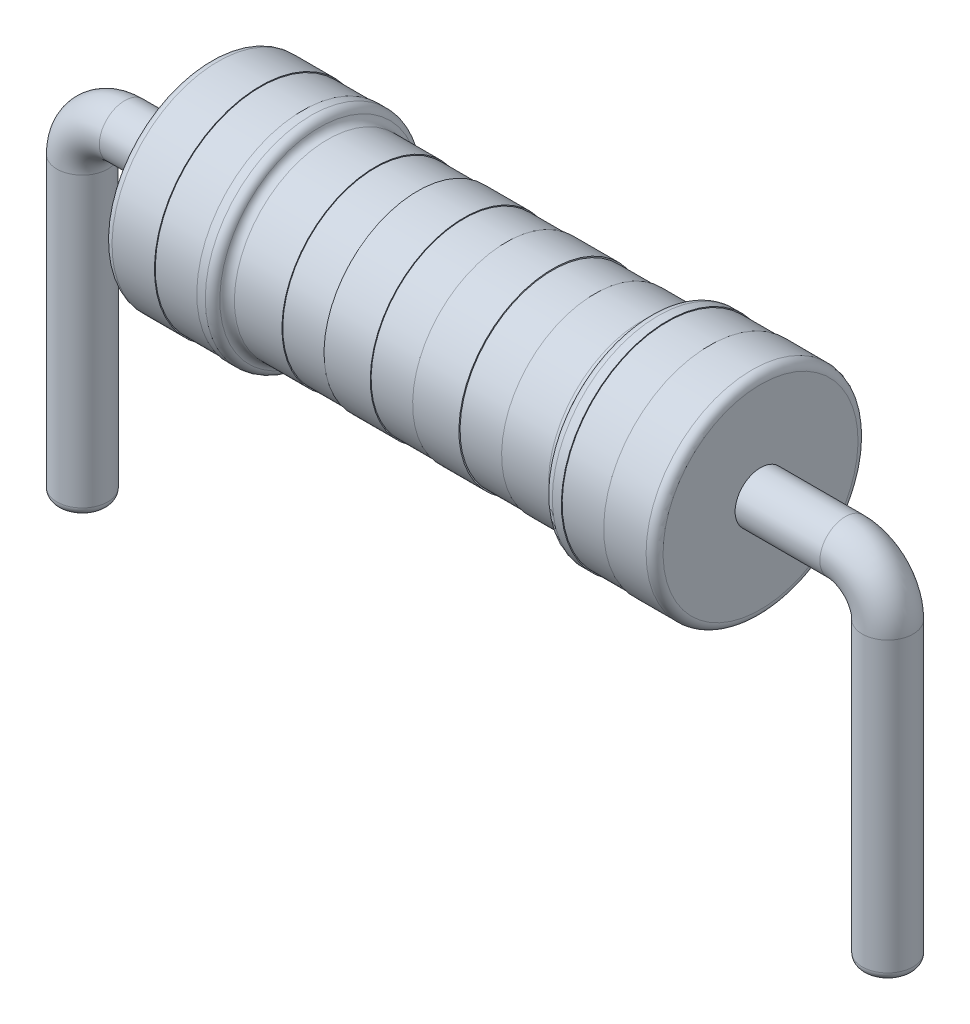
ISO-10303-21;
HEADER;
FILE_DESCRIPTION(('STEP AP214'),'2;1');
FILE_NAME('part.step','',(''),(''),'','','');
FILE_SCHEMA(('AUTOMOTIVE_DESIGN { 1 0 10303 214 1 1 1 1 }'));
ENDSEC;
DATA;
#1=APPLICATION_CONTEXT('core data for automotive mechanical design processes');
#2=APPLICATION_PROTOCOL_DEFINITION('international standard','automotive_design',2000,#1);
#3=PRODUCT_CONTEXT('',#1,'mechanical');
#4=PRODUCT('Part','Part','',(#3));
#5=PRODUCT_RELATED_PRODUCT_CATEGORY('part','',(#4));
#6=PRODUCT_DEFINITION_FORMATION('','',#4);
#7=PRODUCT_DEFINITION_CONTEXT('part definition',#1,'design');
#8=PRODUCT_DEFINITION('design','',#6,#7);
#9=PRODUCT_DEFINITION_SHAPE('','',#8);
#10=(LENGTH_UNIT() NAMED_UNIT(*) SI_UNIT(.MILLI.,.METRE.));
#11=(NAMED_UNIT(*) PLANE_ANGLE_UNIT() SI_UNIT($,.RADIAN.));
#12=(NAMED_UNIT(*) SI_UNIT($,.STERADIAN.) SOLID_ANGLE_UNIT());
#13=UNCERTAINTY_MEASURE_WITH_UNIT(LENGTH_MEASURE(1.E-05),#10,'distance_accuracy_value','');
#14=(GEOMETRIC_REPRESENTATION_CONTEXT(3) GLOBAL_UNCERTAINTY_ASSIGNED_CONTEXT((#13)) GLOBAL_UNIT_ASSIGNED_CONTEXT((#10,
#11,#12)) REPRESENTATION_CONTEXT('',''));
#15=CARTESIAN_POINT('',(0.,0.,0.));
#16=DIRECTION('',(0.,0.,1.));
#17=DIRECTION('',(1.,0.,0.));
#18=AXIS2_PLACEMENT_3D('',#15,#16,#17);
#19=CARTESIAN_POINT('',(3.25,0.,0.));
#20=DIRECTION('',(1.,0.,0.));
#21=DIRECTION('',(0.,1.,0.));
#22=AXIS2_PLACEMENT_3D('',#19,#20,#21);
#23=PLANE('',#22);
#24=CARTESIAN_POINT('',(3.25,0.,0.));
#25=DIRECTION('',(1.,0.,0.));
#26=DIRECTION('',(0.,1.,0.));
#27=AXIS2_PLACEMENT_3D('',#24,#25,#26);
#28=CIRCLE('',#27,0.3);
#29=CARTESIAN_POINT('',(3.25,0.300000000000001,0.));
#30=VERTEX_POINT('',#29);
#31=EDGE_CURVE('E56',#30,#30,#28,.T.);
#32=ORIENTED_EDGE('',*,*,#31,.F.);
#33=EDGE_LOOP('',(#32));
#34=FACE_BOUND('',#33,.T.);
#35=CARTESIAN_POINT('',(3.25,0.,0.));
#36=DIRECTION('',(1.,0.,0.));
#37=DIRECTION('',(0.,1.,0.));
#38=AXIS2_PLACEMENT_3D('',#35,#36,#37);
#39=CIRCLE('',#38,1.15);
#40=CARTESIAN_POINT('',(3.25,1.15,0.));
#41=VERTEX_POINT('',#40);
#42=EDGE_CURVE('E59',#41,#41,#39,.T.);
#43=ORIENTED_EDGE('',*,*,#42,.T.);
#44=EDGE_LOOP('',(#43));
#45=FACE_BOUND('',#44,.T.);
#46=ADVANCED_FACE('F33',(#34,#45),#23,.T.);
#47=CARTESIAN_POINT('',(-3.25,0.,0.));
#48=DIRECTION('',(-1.,0.,0.));
#49=DIRECTION('',(0.,-1.,0.));
#50=AXIS2_PLACEMENT_3D('',#47,#48,#49);
#51=CYLINDRICAL_SURFACE('',#50,1.25);
#52=CARTESIAN_POINT('',(3.15,0.,0.));
#53=DIRECTION('',(1.,0.,0.));
#54=DIRECTION('',(0.,1.,0.));
#55=AXIS2_PLACEMENT_3D('',#52,#53,#54);
#56=CIRCLE('',#55,1.25);
#57=CARTESIAN_POINT('',(3.15,1.25,0.));
#58=VERTEX_POINT('',#57);
#59=EDGE_CURVE('E62',#58,#58,#56,.F.);
#60=ORIENTED_EDGE('',*,*,#59,.T.);
#61=EDGE_LOOP('',(#60));
#62=FACE_BOUND('',#61,.T.);
#63=CARTESIAN_POINT('',(2.65,0.,0.));
#64=DIRECTION('',(-1.,0.,0.));
#65=DIRECTION('',(0.,-1.,0.));
#66=AXIS2_PLACEMENT_3D('',#63,#64,#65);
#67=CIRCLE('',#66,1.25);
#68=CARTESIAN_POINT('',(2.65,-1.25,0.));
#69=VERTEX_POINT('',#68);
#70=EDGE_CURVE('E89',#69,#69,#67,.T.);
#71=ORIENTED_EDGE('',*,*,#70,.F.);
#72=EDGE_LOOP('',(#71));
#73=FACE_BOUND('',#72,.T.);
#74=ADVANCED_FACE('F195',(#62,#73),#51,.T.);
#75=CARTESIAN_POINT('',(2.65,-1.25,0.));
#76=DIRECTION('',(-1.,0.,0.));
#77=DIRECTION('',(0.,-1.,0.));
#78=AXIS2_PLACEMENT_3D('',#75,#76,#77);
#79=PLANE('',#78);
#80=ORIENTED_EDGE('',*,*,#70,.T.);
#81=EDGE_LOOP('',(#80));
#82=FACE_BOUND('',#81,.T.);
#83=CARTESIAN_POINT('',(2.65,0.,0.));
#84=DIRECTION('',(-1.,0.,0.));
#85=DIRECTION('',(0.,-1.,0.));
#86=AXIS2_PLACEMENT_3D('',#83,#84,#85);
#87=CIRCLE('',#86,1.24);
#88=CARTESIAN_POINT('',(2.65,-1.24,0.));
#89=VERTEX_POINT('',#88);
#90=EDGE_CURVE('E92',#89,#89,#87,.T.);
#91=ORIENTED_EDGE('',*,*,#90,.F.);
#92=EDGE_LOOP('',(#91));
#93=FACE_BOUND('',#92,.T.);
#94=ADVANCED_FACE('F201',(#82,#93),#79,.T.);
#95=CARTESIAN_POINT('',(-3.25,0.,0.));
#96=DIRECTION('',(-1.,0.,0.));
#97=DIRECTION('',(0.,-1.,0.));
#98=AXIS2_PLACEMENT_3D('',#95,#96,#97);
#99=CYLINDRICAL_SURFACE('',#98,1.24);
#100=ORIENTED_EDGE('',*,*,#90,.T.);
#101=EDGE_LOOP('',(#100));
#102=FACE_BOUND('',#101,.T.);
#103=CARTESIAN_POINT('',(2.15,0.,0.));
#104=DIRECTION('',(-1.,0.,0.));
#105=DIRECTION('',(0.,-1.,0.));
#106=AXIS2_PLACEMENT_3D('',#103,#104,#105);
#107=CIRCLE('',#106,1.24);
#108=CARTESIAN_POINT('',(2.15,-1.24,0.));
#109=VERTEX_POINT('',#108);
#110=EDGE_CURVE('E95',#109,#109,#107,.T.);
#111=ORIENTED_EDGE('',*,*,#110,.F.);
#112=EDGE_LOOP('',(#111));
#113=FACE_BOUND('',#112,.T.);
#114=ADVANCED_FACE('F209',(#102,#113),#99,.T.);
#115=CARTESIAN_POINT('',(2.15,-1.24,0.));
#116=DIRECTION('',(1.,0.,0.));
#117=DIRECTION('',(0.,1.,0.));
#118=AXIS2_PLACEMENT_3D('',#115,#116,#117);
#119=PLANE('',#118);
#120=ORIENTED_EDGE('',*,*,#110,.T.);
#121=EDGE_LOOP('',(#120));
#122=FACE_BOUND('',#121,.T.);
#123=CARTESIAN_POINT('',(2.15,0.,0.));
#124=DIRECTION('',(-1.,0.,0.));
#125=DIRECTION('',(0.,-1.,0.));
#126=AXIS2_PLACEMENT_3D('',#123,#124,#125);
#127=CIRCLE('',#126,1.25);
#128=CARTESIAN_POINT('',(2.15,-1.25,0.));
#129=VERTEX_POINT('',#128);
#130=EDGE_CURVE('E98',#129,#129,#127,.T.);
#131=ORIENTED_EDGE('',*,*,#130,.F.);
#132=EDGE_LOOP('',(#131));
#133=FACE_BOUND('',#132,.T.);
#134=ADVANCED_FACE('F213',(#122,#133),#119,.T.);
#135=CARTESIAN_POINT('',(-3.25,0.,0.));
#136=DIRECTION('',(-1.,0.,0.));
#137=DIRECTION('',(0.,-1.,0.));
#138=AXIS2_PLACEMENT_3D('',#135,#136,#137);
#139=CYLINDRICAL_SURFACE('',#138,1.25);
#140=CARTESIAN_POINT('',(2.0436491673104,0.,0.));
#141=DIRECTION('',(1.,0.,0.));
#142=DIRECTION('',(0.,1.,0.));
#143=AXIS2_PLACEMENT_3D('',#140,#141,#142);
#144=CIRCLE('',#143,1.25);
#145=CARTESIAN_POINT('',(2.0436491673104,1.25,0.));
#146=VERTEX_POINT('',#145);
#147=EDGE_CURVE('E71',#146,#146,#144,.T.);
#148=ORIENTED_EDGE('',*,*,#147,.T.);
#149=EDGE_LOOP('',(#148));
#150=FACE_BOUND('',#149,.T.);
#151=ORIENTED_EDGE('',*,*,#130,.T.);
#152=EDGE_LOOP('',(#151));
#153=FACE_BOUND('',#152,.T.);
#154=ADVANCED_FACE('F217',(#150,#153),#139,.T.);
#155=CARTESIAN_POINT('',(-3.25,0.,0.));
#156=DIRECTION('',(-1.,0.,0.));
#157=DIRECTION('',(0.,-1.,0.));
#158=AXIS2_PLACEMENT_3D('',#155,#156,#157);
#159=CYLINDRICAL_SURFACE('',#158,1.1);
#160=CARTESIAN_POINT('',(1.85,0.,0.));
#161=DIRECTION('',(-1.,0.,0.));
#162=DIRECTION('',(0.,-1.,0.));
#163=AXIS2_PLACEMENT_3D('',#160,#161,#162);
#164=CIRCLE('',#163,1.1);
#165=CARTESIAN_POINT('',(1.85,-1.1,0.));
#166=VERTEX_POINT('',#165);
#167=EDGE_CURVE('E86',#166,#166,#164,.T.);
#168=ORIENTED_EDGE('',*,*,#167,.T.);
#169=EDGE_LOOP('',(#168));
#170=FACE_BOUND('',#169,.T.);
#171=CARTESIAN_POINT('',(1.29552343653446,0.,0.));
#172=DIRECTION('',(-1.,0.,0.));
#173=DIRECTION('',(0.,-1.,0.));
#174=AXIS2_PLACEMENT_3D('',#171,#172,#173);
#175=CIRCLE('',#174,1.1);
#176=CARTESIAN_POINT('',(1.29552343653446,-1.1,0.));
#177=VERTEX_POINT('',#176);
#178=EDGE_CURVE('E101',#177,#177,#175,.T.);
#179=ORIENTED_EDGE('',*,*,#178,.F.);
#180=EDGE_LOOP('',(#179));
#181=FACE_BOUND('',#180,.T.);
#182=ADVANCED_FACE('F221',(#170,#181),#159,.T.);
#183=CARTESIAN_POINT('',(1.29552343653446,-1.1,0.));
#184=DIRECTION('',(-1.,0.,0.));
#185=DIRECTION('',(0.,-1.,0.));
#186=AXIS2_PLACEMENT_3D('',#183,#184,#185);
#187=PLANE('',#186);
#188=ORIENTED_EDGE('',*,*,#178,.T.);
#189=EDGE_LOOP('',(#188));
#190=FACE_BOUND('',#189,.T.);
#191=CARTESIAN_POINT('',(1.29552343653446,0.,0.));
#192=DIRECTION('',(-1.,0.,0.));
#193=DIRECTION('',(0.,-1.,0.));
#194=AXIS2_PLACEMENT_3D('',#191,#192,#193);
#195=CIRCLE('',#194,1.09);
#196=CARTESIAN_POINT('',(1.29552343653446,-1.09,0.));
#197=VERTEX_POINT('',#196);
#198=EDGE_CURVE('E104',#197,#197,#195,.T.);
#199=ORIENTED_EDGE('',*,*,#198,.F.);
#200=EDGE_LOOP('',(#199));
#201=FACE_BOUND('',#200,.T.);
#202=ADVANCED_FACE('F225',(#190,#201),#187,.T.);
#203=CARTESIAN_POINT('',(-3.25,0.,0.));
#204=DIRECTION('',(-1.,0.,0.));
#205=DIRECTION('',(0.,-1.,0.));
#206=AXIS2_PLACEMENT_3D('',#203,#204,#205);
#207=CYLINDRICAL_SURFACE('',#206,1.09);
#208=ORIENTED_EDGE('',*,*,#198,.T.);
#209=EDGE_LOOP('',(#208));
#210=FACE_BOUND('',#209,.T.);
#211=CARTESIAN_POINT('',(0.795523436534458,0.,0.));
#212=DIRECTION('',(-1.,0.,0.));
#213=DIRECTION('',(0.,-1.,0.));
#214=AXIS2_PLACEMENT_3D('',#211,#212,#213);
#215=CIRCLE('',#214,1.09);
#216=CARTESIAN_POINT('',(0.795523436534458,-1.09,0.));
#217=VERTEX_POINT('',#216);
#218=EDGE_CURVE('E107',#217,#217,#215,.T.);
#219=ORIENTED_EDGE('',*,*,#218,.F.);
#220=EDGE_LOOP('',(#219));
#221=FACE_BOUND('',#220,.T.);
#222=ADVANCED_FACE('F229',(#210,#221),#207,.T.);
#223=CARTESIAN_POINT('',(0.795523436534458,-1.09,0.));
#224=DIRECTION('',(1.,0.,0.));
#225=DIRECTION('',(0.,1.,0.));
#226=AXIS2_PLACEMENT_3D('',#223,#224,#225);
#227=PLANE('',#226);
#228=ORIENTED_EDGE('',*,*,#218,.T.);
#229=EDGE_LOOP('',(#228));
#230=FACE_BOUND('',#229,.T.);
#231=CARTESIAN_POINT('',(0.795523436534458,0.,0.));
#232=DIRECTION('',(-1.,0.,0.));
#233=DIRECTION('',(0.,-1.,0.));
#234=AXIS2_PLACEMENT_3D('',#231,#232,#233);
#235=CIRCLE('',#234,1.10375370034682);
#236=CARTESIAN_POINT('',(0.795523436534458,-1.10375370034682,0.));
#237=VERTEX_POINT('',#236);
#238=EDGE_CURVE('E110',#237,#237,#235,.T.);
#239=ORIENTED_EDGE('',*,*,#238,.F.);
#240=EDGE_LOOP('',(#239));
#241=FACE_BOUND('',#240,.T.);
#242=ADVANCED_FACE('F233',(#230,#241),#227,.T.);
#243=CARTESIAN_POINT('',(-3.25,0.,0.));
#244=DIRECTION('',(-1.,0.,0.));
#245=DIRECTION('',(0.,-1.,0.));
#246=AXIS2_PLACEMENT_3D('',#243,#244,#245);
#247=CYLINDRICAL_SURFACE('',#246,1.10375370034682);
#248=ORIENTED_EDGE('',*,*,#238,.T.);
#249=EDGE_LOOP('',(#248));
#250=FACE_BOUND('',#249,.T.);
#251=CARTESIAN_POINT('',(0.25,0.,0.));
#252=DIRECTION('',(-1.,0.,0.));
#253=DIRECTION('',(0.,-1.,0.));
#254=AXIS2_PLACEMENT_3D('',#251,#252,#253);
#255=CIRCLE('',#254,1.10375370034682);
#256=CARTESIAN_POINT('',(0.25,-1.10375370034682,0.));
#257=VERTEX_POINT('',#256);
#258=EDGE_CURVE('E113',#257,#257,#255,.T.);
#259=ORIENTED_EDGE('',*,*,#258,.F.);
#260=EDGE_LOOP('',(#259));
#261=FACE_BOUND('',#260,.T.);
#262=ADVANCED_FACE('F237',(#250,#261),#247,.T.);
#263=CARTESIAN_POINT('',(0.25,-1.10375370034682,0.));
#264=DIRECTION('',(-1.,0.,0.));
#265=DIRECTION('',(0.,-1.,0.));
#266=AXIS2_PLACEMENT_3D('',#263,#264,#265);
#267=PLANE('',#266);
#268=ORIENTED_EDGE('',*,*,#258,.T.);
#269=EDGE_LOOP('',(#268));
#270=FACE_BOUND('',#269,.T.);
#271=CARTESIAN_POINT('',(0.25,0.,0.));
#272=DIRECTION('',(-1.,0.,0.));
#273=DIRECTION('',(0.,-1.,0.));
#274=AXIS2_PLACEMENT_3D('',#271,#272,#273);
#275=CIRCLE('',#274,1.09375370034682);
#276=CARTESIAN_POINT('',(0.25,-1.09375370034682,0.));
#277=VERTEX_POINT('',#276);
#278=EDGE_CURVE('E116',#277,#277,#275,.T.);
#279=ORIENTED_EDGE('',*,*,#278,.F.);
#280=EDGE_LOOP('',(#279));
#281=FACE_BOUND('',#280,.T.);
#282=ADVANCED_FACE('F241',(#270,#281),#267,.T.);
#283=CARTESIAN_POINT('',(-3.25,0.,0.));
#284=DIRECTION('',(-1.,0.,0.));
#285=DIRECTION('',(0.,-1.,0.));
#286=AXIS2_PLACEMENT_3D('',#283,#284,#285);
#287=CYLINDRICAL_SURFACE('',#286,1.09375370034682);
#288=ORIENTED_EDGE('',*,*,#278,.T.);
#289=EDGE_LOOP('',(#288));
#290=FACE_BOUND('',#289,.T.);
#291=CARTESIAN_POINT('',(-0.25,0.,0.));
#292=DIRECTION('',(-1.,0.,0.));
#293=DIRECTION('',(0.,-1.,0.));
#294=AXIS2_PLACEMENT_3D('',#291,#292,#293);
#295=CIRCLE('',#294,1.09375370034682);
#296=CARTESIAN_POINT('',(-0.25,-1.09375370034682,0.));
#297=VERTEX_POINT('',#296);
#298=EDGE_CURVE('E119',#297,#297,#295,.T.);
#299=ORIENTED_EDGE('',*,*,#298,.F.);
#300=EDGE_LOOP('',(#299));
#301=FACE_BOUND('',#300,.T.);
#302=ADVANCED_FACE('F245',(#290,#301),#287,.T.);
#303=CARTESIAN_POINT('',(-0.25,-1.10375370034682,0.));
#304=DIRECTION('',(1.,0.,0.));
#305=DIRECTION('',(0.,1.,0.));
#306=AXIS2_PLACEMENT_3D('',#303,#304,#305);
#307=PLANE('',#306);
#308=ORIENTED_EDGE('',*,*,#298,.T.);
#309=EDGE_LOOP('',(#308));
#310=FACE_BOUND('',#309,.T.);
#311=CARTESIAN_POINT('',(-0.25,0.,0.));
#312=DIRECTION('',(-1.,0.,0.));
#313=DIRECTION('',(0.,-1.,0.));
#314=AXIS2_PLACEMENT_3D('',#311,#312,#313);
#315=CIRCLE('',#314,1.10375370034682);
#316=CARTESIAN_POINT('',(-0.25,-1.10375370034682,0.));
#317=VERTEX_POINT('',#316);
#318=EDGE_CURVE('E122',#317,#317,#315,.T.);
#319=ORIENTED_EDGE('',*,*,#318,.F.);
#320=EDGE_LOOP('',(#319));
#321=FACE_BOUND('',#320,.T.);
#322=ADVANCED_FACE('F249',(#310,#321),#307,.T.);
#323=CARTESIAN_POINT('',(-3.25,0.,0.));
#324=DIRECTION('',(-1.,0.,0.));
#325=DIRECTION('',(0.,-1.,0.));
#326=AXIS2_PLACEMENT_3D('',#323,#324,#325);
#327=CYLINDRICAL_SURFACE('',#326,1.10375370034682);
#328=ORIENTED_EDGE('',*,*,#318,.T.);
#329=EDGE_LOOP('',(#328));
#330=FACE_BOUND('',#329,.T.);
#331=CARTESIAN_POINT('',(-0.795523436534458,0.,0.));
#332=DIRECTION('',(-1.,0.,0.));
#333=DIRECTION('',(0.,-1.,0.));
#334=AXIS2_PLACEMENT_3D('',#331,#332,#333);
#335=CIRCLE('',#334,1.10375370034682);
#336=CARTESIAN_POINT('',(-0.795523436534457,-1.10375370034682,0.));
#337=VERTEX_POINT('',#336);
#338=EDGE_CURVE('E125',#337,#337,#335,.T.);
#339=ORIENTED_EDGE('',*,*,#338,.F.);
#340=EDGE_LOOP('',(#339));
#341=FACE_BOUND('',#340,.T.);
#342=ADVANCED_FACE('F253',(#330,#341),#327,.T.);
#343=CARTESIAN_POINT('',(-0.795523436534457,-1.09,0.));
#344=DIRECTION('',(-1.,0.,0.));
#345=DIRECTION('',(0.,-1.,0.));
#346=AXIS2_PLACEMENT_3D('',#343,#344,#345);
#347=PLANE('',#346);
#348=ORIENTED_EDGE('',*,*,#338,.T.);
#349=EDGE_LOOP('',(#348));
#350=FACE_BOUND('',#349,.T.);
#351=CARTESIAN_POINT('',(-0.795523436534458,0.,0.));
#352=DIRECTION('',(-1.,0.,0.));
#353=DIRECTION('',(0.,-1.,0.));
#354=AXIS2_PLACEMENT_3D('',#351,#352,#353);
#355=CIRCLE('',#354,1.09);
#356=CARTESIAN_POINT('',(-0.795523436534457,-1.09,0.));
#357=VERTEX_POINT('',#356);
#358=EDGE_CURVE('E128',#357,#357,#355,.T.);
#359=ORIENTED_EDGE('',*,*,#358,.F.);
#360=EDGE_LOOP('',(#359));
#361=FACE_BOUND('',#360,.T.);
#362=ADVANCED_FACE('F257',(#350,#361),#347,.T.);
#363=CARTESIAN_POINT('',(-3.25,0.,0.));
#364=DIRECTION('',(-1.,0.,0.));
#365=DIRECTION('',(0.,-1.,0.));
#366=AXIS2_PLACEMENT_3D('',#363,#364,#365);
#367=CYLINDRICAL_SURFACE('',#366,1.09);
#368=ORIENTED_EDGE('',*,*,#358,.T.);
#369=EDGE_LOOP('',(#368));
#370=FACE_BOUND('',#369,.T.);
#371=CARTESIAN_POINT('',(-1.29552343653446,0.,0.));
#372=DIRECTION('',(-1.,0.,0.));
#373=DIRECTION('',(0.,-1.,0.));
#374=AXIS2_PLACEMENT_3D('',#371,#372,#373);
#375=CIRCLE('',#374,1.09);
#376=CARTESIAN_POINT('',(-1.29552343653446,-1.09,0.));
#377=VERTEX_POINT('',#376);
#378=EDGE_CURVE('E131',#377,#377,#375,.T.);
#379=ORIENTED_EDGE('',*,*,#378,.F.);
#380=EDGE_LOOP('',(#379));
#381=FACE_BOUND('',#380,.T.);
#382=ADVANCED_FACE('F261',(#370,#381),#367,.T.);
#383=CARTESIAN_POINT('',(-1.29552343653446,-1.1,0.));
#384=DIRECTION('',(1.,0.,0.));
#385=DIRECTION('',(0.,1.,0.));
#386=AXIS2_PLACEMENT_3D('',#383,#384,#385);
#387=PLANE('',#386);
#388=ORIENTED_EDGE('',*,*,#378,.T.);
#389=EDGE_LOOP('',(#388));
#390=FACE_BOUND('',#389,.T.);
#391=CARTESIAN_POINT('',(-1.29552343653446,0.,0.));
#392=DIRECTION('',(-1.,0.,0.));
#393=DIRECTION('',(0.,-1.,0.));
#394=AXIS2_PLACEMENT_3D('',#391,#392,#393);
#395=CIRCLE('',#394,1.1);
#396=CARTESIAN_POINT('',(-1.29552343653446,-1.1,0.));
#397=VERTEX_POINT('',#396);
#398=EDGE_CURVE('E134',#397,#397,#395,.T.);
#399=ORIENTED_EDGE('',*,*,#398,.F.);
#400=EDGE_LOOP('',(#399));
#401=FACE_BOUND('',#400,.T.);
#402=ADVANCED_FACE('F265',(#390,#401),#387,.T.);
#403=CARTESIAN_POINT('',(-3.25,0.,0.));
#404=DIRECTION('',(-1.,0.,0.));
#405=DIRECTION('',(0.,-1.,0.));
#406=AXIS2_PLACEMENT_3D('',#403,#404,#405);
#407=CYLINDRICAL_SURFACE('',#406,1.1);
#408=CARTESIAN_POINT('',(-1.85635083268958,0.,0.));
#409=DIRECTION('',(-1.,0.,0.));
#410=DIRECTION('',(0.,-1.,0.));
#411=AXIS2_PLACEMENT_3D('',#408,#409,#410);
#412=CIRCLE('',#411,1.1);
#413=CARTESIAN_POINT('',(-1.85635083268958,-1.1,0.));
#414=VERTEX_POINT('',#413);
#415=EDGE_CURVE('E65',#414,#414,#412,.F.);
#416=ORIENTED_EDGE('',*,*,#415,.T.);
#417=EDGE_LOOP('',(#416));
#418=FACE_BOUND('',#417,.T.);
#419=ORIENTED_EDGE('',*,*,#398,.T.);
#420=EDGE_LOOP('',(#419));
#421=FACE_BOUND('',#420,.T.);
#422=ADVANCED_FACE('F269',(#418,#421),#407,.T.);
#423=CARTESIAN_POINT('',(-3.25,0.,0.));
#424=DIRECTION('',(-1.,0.,0.));
#425=DIRECTION('',(0.,-1.,0.));
#426=AXIS2_PLACEMENT_3D('',#423,#424,#425);
#427=CYLINDRICAL_SURFACE('',#426,1.25);
#428=CARTESIAN_POINT('',(-2.05,0.,0.));
#429=DIRECTION('',(1.,0.,0.));
#430=DIRECTION('',(0.,1.,0.));
#431=AXIS2_PLACEMENT_3D('',#428,#429,#430);
#432=CIRCLE('',#431,1.25);
#433=CARTESIAN_POINT('',(-2.05,1.25,0.));
#434=VERTEX_POINT('',#433);
#435=EDGE_CURVE('E77',#434,#434,#432,.F.);
#436=ORIENTED_EDGE('',*,*,#435,.T.);
#437=EDGE_LOOP('',(#436));
#438=FACE_BOUND('',#437,.T.);
#439=CARTESIAN_POINT('',(-2.15,0.,0.));
#440=DIRECTION('',(-1.,0.,0.));
#441=DIRECTION('',(0.,-1.,0.));
#442=AXIS2_PLACEMENT_3D('',#439,#440,#441);
#443=CIRCLE('',#442,1.25);
#444=CARTESIAN_POINT('',(-2.15,-1.25,0.));
#445=VERTEX_POINT('',#444);
#446=EDGE_CURVE('E137',#445,#445,#443,.T.);
#447=ORIENTED_EDGE('',*,*,#446,.F.);
#448=EDGE_LOOP('',(#447));
#449=FACE_BOUND('',#448,.T.);
#450=ADVANCED_FACE('F273',(#438,#449),#427,.T.);
#451=CARTESIAN_POINT('',(-2.15,-1.24,0.));
#452=DIRECTION('',(-1.,0.,0.));
#453=DIRECTION('',(0.,-1.,0.));
#454=AXIS2_PLACEMENT_3D('',#451,#452,#453);
#455=PLANE('',#454);
#456=ORIENTED_EDGE('',*,*,#446,.T.);
#457=EDGE_LOOP('',(#456));
#458=FACE_BOUND('',#457,.T.);
#459=CARTESIAN_POINT('',(-2.15,0.,0.));
#460=DIRECTION('',(-1.,0.,0.));
#461=DIRECTION('',(0.,-1.,0.));
#462=AXIS2_PLACEMENT_3D('',#459,#460,#461);
#463=CIRCLE('',#462,1.24);
#464=CARTESIAN_POINT('',(-2.15,-1.24,0.));
#465=VERTEX_POINT('',#464);
#466=EDGE_CURVE('E140',#465,#465,#463,.T.);
#467=ORIENTED_EDGE('',*,*,#466,.F.);
#468=EDGE_LOOP('',(#467));
#469=FACE_BOUND('',#468,.T.);
#470=ADVANCED_FACE('F277',(#458,#469),#455,.T.);
#471=CARTESIAN_POINT('',(-3.25,0.,0.));
#472=DIRECTION('',(-1.,0.,0.));
#473=DIRECTION('',(0.,-1.,0.));
#474=AXIS2_PLACEMENT_3D('',#471,#472,#473);
#475=CYLINDRICAL_SURFACE('',#474,1.24);
#476=ORIENTED_EDGE('',*,*,#466,.T.);
#477=EDGE_LOOP('',(#476));
#478=FACE_BOUND('',#477,.T.);
#479=CARTESIAN_POINT('',(-2.65,0.,0.));
#480=DIRECTION('',(-1.,0.,0.));
#481=DIRECTION('',(0.,-1.,0.));
#482=AXIS2_PLACEMENT_3D('',#479,#480,#481);
#483=CIRCLE('',#482,1.24);
#484=CARTESIAN_POINT('',(-2.65,-1.24,0.));
#485=VERTEX_POINT('',#484);
#486=EDGE_CURVE('E143',#485,#485,#483,.T.);
#487=ORIENTED_EDGE('',*,*,#486,.F.);
#488=EDGE_LOOP('',(#487));
#489=FACE_BOUND('',#488,.T.);
#490=ADVANCED_FACE('F281',(#478,#489),#475,.T.);
#491=CARTESIAN_POINT('',(-2.65,-1.25,0.));
#492=DIRECTION('',(1.,0.,0.));
#493=DIRECTION('',(0.,1.,0.));
#494=AXIS2_PLACEMENT_3D('',#491,#492,#493);
#495=PLANE('',#494);
#496=ORIENTED_EDGE('',*,*,#486,.T.);
#497=EDGE_LOOP('',(#496));
#498=FACE_BOUND('',#497,.T.);
#499=CARTESIAN_POINT('',(-2.65,0.,0.));
#500=DIRECTION('',(-1.,0.,0.));
#501=DIRECTION('',(0.,-1.,0.));
#502=AXIS2_PLACEMENT_3D('',#499,#500,#501);
#503=CIRCLE('',#502,1.25);
#504=CARTESIAN_POINT('',(-2.65,-1.25,0.));
#505=VERTEX_POINT('',#504);
#506=EDGE_CURVE('E146',#505,#505,#503,.T.);
#507=ORIENTED_EDGE('',*,*,#506,.F.);
#508=EDGE_LOOP('',(#507));
#509=FACE_BOUND('',#508,.T.);
#510=ADVANCED_FACE('F285',(#498,#509),#495,.T.);
#511=CARTESIAN_POINT('',(-3.25,0.,0.));
#512=DIRECTION('',(-1.,0.,0.));
#513=DIRECTION('',(0.,-1.,0.));
#514=AXIS2_PLACEMENT_3D('',#511,#512,#513);
#515=CYLINDRICAL_SURFACE('',#514,1.25);
#516=CARTESIAN_POINT('',(-3.15,0.,0.));
#517=DIRECTION('',(-1.,0.,0.));
#518=DIRECTION('',(0.,-1.,0.));
#519=AXIS2_PLACEMENT_3D('',#516,#517,#518);
#520=CIRCLE('',#519,1.25);
#521=CARTESIAN_POINT('',(-3.15,-1.25,0.));
#522=VERTEX_POINT('',#521);
#523=EDGE_CURVE('E80',#522,#522,#520,.F.);
#524=ORIENTED_EDGE('',*,*,#523,.T.);
#525=EDGE_LOOP('',(#524));
#526=FACE_BOUND('',#525,.T.);
#527=ORIENTED_EDGE('',*,*,#506,.T.);
#528=EDGE_LOOP('',(#527));
#529=FACE_BOUND('',#528,.T.);
#530=ADVANCED_FACE('F175',(#526,#529),#515,.T.);
#531=CARTESIAN_POINT('',(-3.25,0.,0.));
#532=DIRECTION('',(-1.,0.,0.));
#533=DIRECTION('',(0.,-1.,0.));
#534=AXIS2_PLACEMENT_3D('',#531,#532,#533);
#535=PLANE('',#534);
#536=CARTESIAN_POINT('',(-3.25,0.,0.));
#537=DIRECTION('',(-1.,0.,0.));
#538=DIRECTION('',(0.,-1.,0.));
#539=AXIS2_PLACEMENT_3D('',#536,#537,#538);
#540=CIRCLE('',#539,0.3);
#541=CARTESIAN_POINT('',(-3.25,-0.299999999999999,0.));
#542=VERTEX_POINT('',#541);
#543=EDGE_CURVE('E53',#542,#542,#540,.T.);
#544=ORIENTED_EDGE('',*,*,#543,.F.);
#545=EDGE_LOOP('',(#544));
#546=FACE_BOUND('',#545,.T.);
#547=CARTESIAN_POINT('',(-3.25,0.,0.));
#548=DIRECTION('',(-1.,0.,0.));
#549=DIRECTION('',(0.,-1.,0.));
#550=AXIS2_PLACEMENT_3D('',#547,#548,#549);
#551=CIRCLE('',#550,1.15);
#552=CARTESIAN_POINT('',(-3.25,-1.15,0.));
#553=VERTEX_POINT('',#552);
#554=EDGE_CURVE('E83',#553,#553,#551,.T.);
#555=ORIENTED_EDGE('',*,*,#554,.T.);
#556=EDGE_LOOP('',(#555));
#557=FACE_BOUND('',#556,.T.);
#558=ADVANCED_FACE('F171',(#546,#557),#535,.T.);
#559=CARTESIAN_POINT('',(1.85,0.,0.));
#560=DIRECTION('',(-1.,0.,0.));
#561=DIRECTION('',(0.,-1.,0.));
#562=AXIS2_PLACEMENT_3D('',#559,#560,#561);
#563=TOROIDAL_SURFACE('',#562,1.2,0.1);
#564=CARTESIAN_POINT('',(1.94682458365521,0.,0.));
#565=DIRECTION('',(-1.,0.,0.));
#566=DIRECTION('',(0.,-1.,0.));
#567=AXIS2_PLACEMENT_3D('',#564,#565,#566);
#568=CIRCLE('',#567,1.175);
#569=CARTESIAN_POINT('',(1.94682458365521,-1.175,0.));
#570=VERTEX_POINT('',#569);
#571=EDGE_CURVE('E74',#570,#570,#568,.T.);
#572=ORIENTED_EDGE('',*,*,#571,.T.);
#573=EDGE_LOOP('',(#572));
#574=FACE_BOUND('',#573,.T.);
#575=ORIENTED_EDGE('',*,*,#167,.F.);
#576=EDGE_LOOP('',(#575));
#577=FACE_BOUND('',#576,.T.);
#578=ADVANCED_FACE('F174',(#574,#577),#563,.F.);
#579=CARTESIAN_POINT('',(-3.15,0.,0.));
#580=DIRECTION('',(-1.,0.,0.));
#581=DIRECTION('',(0.,-1.,0.));
#582=AXIS2_PLACEMENT_3D('',#579,#580,#581);
#583=TOROIDAL_SURFACE('',#582,1.15,0.1);
#584=ORIENTED_EDGE('',*,*,#523,.F.);
#585=EDGE_LOOP('',(#584));
#586=FACE_BOUND('',#585,.T.);
#587=ORIENTED_EDGE('',*,*,#554,.F.);
#588=EDGE_LOOP('',(#587));
#589=FACE_BOUND('',#588,.T.);
#590=ADVANCED_FACE('F179',(#586,#589),#583,.T.);
#591=CARTESIAN_POINT('',(-2.05,0.,0.));
#592=DIRECTION('',(1.,0.,0.));
#593=DIRECTION('',(0.,1.,0.));
#594=AXIS2_PLACEMENT_3D('',#591,#592,#593);
#595=TOROIDAL_SURFACE('',#594,1.15,0.1);
#596=CARTESIAN_POINT('',(-1.95317541634478,0.,0.));
#597=DIRECTION('',(-1.,0.,0.));
#598=DIRECTION('',(0.,-1.,0.));
#599=AXIS2_PLACEMENT_3D('',#596,#597,#598);
#600=CIRCLE('',#599,1.175);
#601=CARTESIAN_POINT('',(-1.95317541634478,-1.175,0.));
#602=VERTEX_POINT('',#601);
#603=EDGE_CURVE('E68',#602,#602,#600,.T.);
#604=ORIENTED_EDGE('',*,*,#603,.T.);
#605=EDGE_LOOP('',(#604));
#606=FACE_BOUND('',#605,.T.);
#607=ORIENTED_EDGE('',*,*,#435,.F.);
#608=EDGE_LOOP('',(#607));
#609=FACE_BOUND('',#608,.T.);
#610=ADVANCED_FACE('F181',(#606,#609),#595,.T.);
#611=CARTESIAN_POINT('',(2.0436491673104,0.,0.));
#612=DIRECTION('',(1.,0.,0.));
#613=DIRECTION('',(0.,1.,0.));
#614=AXIS2_PLACEMENT_3D('',#611,#612,#613);
#615=TOROIDAL_SURFACE('',#614,1.15000000000001,0.1);
#616=ORIENTED_EDGE('',*,*,#147,.F.);
#617=EDGE_LOOP('',(#616));
#618=FACE_BOUND('',#617,.T.);
#619=ORIENTED_EDGE('',*,*,#571,.F.);
#620=EDGE_LOOP('',(#619));
#621=FACE_BOUND('',#620,.T.);
#622=ADVANCED_FACE('F188',(#618,#621),#615,.T.);
#623=CARTESIAN_POINT('',(-1.85635083268958,0.,0.));
#624=DIRECTION('',(-1.,0.,0.));
#625=DIRECTION('',(0.,-1.,0.));
#626=AXIS2_PLACEMENT_3D('',#623,#624,#625);
#627=TOROIDAL_SURFACE('',#626,1.19999999999999,0.1);
#628=ORIENTED_EDGE('',*,*,#415,.F.);
#629=EDGE_LOOP('',(#628));
#630=FACE_BOUND('',#629,.T.);
#631=ORIENTED_EDGE('',*,*,#603,.F.);
#632=EDGE_LOOP('',(#631));
#633=FACE_BOUND('',#632,.T.);
#634=ADVANCED_FACE('F377',(#630,#633),#627,.F.);
#635=CARTESIAN_POINT('',(3.15,0.,0.));
#636=DIRECTION('',(1.,0.,0.));
#637=DIRECTION('',(0.,1.,0.));
#638=AXIS2_PLACEMENT_3D('',#635,#636,#637);
#639=TOROIDAL_SURFACE('',#638,1.15,0.1);
#640=ORIENTED_EDGE('',*,*,#42,.F.);
#641=EDGE_LOOP('',(#640));
#642=FACE_BOUND('',#641,.T.);
#643=ORIENTED_EDGE('',*,*,#59,.F.);
#644=EDGE_LOOP('',(#643));
#645=FACE_BOUND('',#644,.T.);
#646=ADVANCED_FACE('F297',(#642,#645),#639,.T.);
#647=CARTESIAN_POINT('',(4.75,-4.,0.));
#648=DIRECTION('',(0.,-1.,0.));
#649=DIRECTION('',(1.,0.,0.));
#650=AXIS2_PLACEMENT_3D('',#647,#648,#649);
#651=PLANE('',#650);
#652=CARTESIAN_POINT('',(4.75,-4.,0.));
#653=DIRECTION('',(0.,-1.,0.));
#654=DIRECTION('',(1.,0.,0.));
#655=AXIS2_PLACEMENT_3D('',#652,#653,#654);
#656=CIRCLE('',#655,0.2);
#657=CARTESIAN_POINT('',(4.95,-4.,0.));
#658=VERTEX_POINT('',#657);
#659=EDGE_CURVE('E48',#658,#658,#656,.T.);
#660=ORIENTED_EDGE('',*,*,#659,.T.);
#661=EDGE_LOOP('',(#660));
#662=FACE_BOUND('',#661,.T.);
#663=ADVANCED_FACE('F293',(#662),#651,.T.);
#664=CARTESIAN_POINT('',(3.25,0.,0.));
#665=DIRECTION('',(1.,0.,0.));
#666=DIRECTION('',(0.,1.,0.));
#667=AXIS2_PLACEMENT_3D('',#664,#665,#666);
#668=CYLINDRICAL_SURFACE('',#667,0.3);
#669=CARTESIAN_POINT('',(4.25,0.,0.));
#670=DIRECTION('',(1.,0.,0.));
#671=DIRECTION('',(0.,1.,0.));
#672=AXIS2_PLACEMENT_3D('',#669,#670,#671);
#673=CIRCLE('',#672,0.3);
#674=CARTESIAN_POINT('',(4.25,0.299999999999993,0.));
#675=VERTEX_POINT('',#674);
#676=EDGE_CURVE('E152',#675,#675,#673,.T.);
#677=ORIENTED_EDGE('',*,*,#676,.F.);
#678=EDGE_LOOP('',(#677));
#679=FACE_BOUND('',#678,.T.);
#680=ORIENTED_EDGE('',*,*,#31,.T.);
#681=EDGE_LOOP('',(#680));
#682=FACE_BOUND('',#681,.T.);
#683=ADVANCED_FACE('F296',(#679,#682),#668,.T.);
#684=CARTESIAN_POINT('',(4.25,-0.5,0.));
#685=DIRECTION('',(0.,0.,-1.));
#686=DIRECTION('',(-1.,0.,0.));
#687=AXIS2_PLACEMENT_3D('',#684,#685,#686);
#688=TOROIDAL_SURFACE('',#687,0.499999999999993,0.3);
#689=CARTESIAN_POINT('',(4.75,-0.5,0.));
#690=DIRECTION('',(0.,-1.,0.));
#691=DIRECTION('',(1.,0.,0.));
#692=AXIS2_PLACEMENT_3D('',#689,#690,#691);
#693=CIRCLE('',#692,0.3);
#694=CARTESIAN_POINT('',(5.04999999999999,-0.5,0.));
#695=VERTEX_POINT('',#694);
#696=EDGE_CURVE('E149',#695,#695,#693,.T.);
#697=CARTESIAN_POINT('',(4.25,-0.5,0.));
#698=DIRECTION('',(0.,0.,-1.));
#699=DIRECTION('',(-1.,0.,0.));
#700=AXIS2_PLACEMENT_3D('',#697,#698,#699);
#701=CIRCLE('',#700,0.799999999999993);
#702=EDGE_CURVE('',#675,#695,#701,.T.);
#703=ORIENTED_EDGE('',*,*,#676,.T.);
#704=ORIENTED_EDGE('',*,*,#696,.F.);
#705=ORIENTED_EDGE('',*,*,#702,.T.);
#706=ORIENTED_EDGE('',*,*,#702,.F.);
#707=EDGE_LOOP('',(#703,#705,#704,#706));
#708=FACE_BOUND('',#707,.T.);
#709=ADVANCED_FACE('F303',(#708),#688,.T.);
#710=CARTESIAN_POINT('',(4.75,-0.5,0.));
#711=DIRECTION('',(0.,-1.,0.));
#712=DIRECTION('',(0.,0.,-1.));
#713=AXIS2_PLACEMENT_3D('',#710,#711,#712);
#714=CYLINDRICAL_SURFACE('',#713,0.3);
#715=CARTESIAN_POINT('',(4.75,-3.9,0.));
#716=DIRECTION('',(0.,-1.,0.));
#717=DIRECTION('',(1.,0.,0.));
#718=AXIS2_PLACEMENT_3D('',#715,#716,#717);
#719=CIRCLE('',#718,0.3);
#720=CARTESIAN_POINT('',(5.05,-3.9,0.));
#721=VERTEX_POINT('',#720);
#722=EDGE_CURVE('E44',#721,#721,#719,.F.);
#723=ORIENTED_EDGE('',*,*,#722,.T.);
#724=EDGE_LOOP('',(#723));
#725=FACE_BOUND('',#724,.T.);
#726=ORIENTED_EDGE('',*,*,#696,.T.);
#727=EDGE_LOOP('',(#726));
#728=FACE_BOUND('',#727,.T.);
#729=ADVANCED_FACE('F300',(#725,#728),#714,.T.);
#730=CARTESIAN_POINT('',(-4.75,-4.,0.));
#731=DIRECTION('',(0.,-1.,0.));
#732=DIRECTION('',(-1.,0.,0.));
#733=AXIS2_PLACEMENT_3D('',#730,#731,#732);
#734=PLANE('',#733);
#735=CARTESIAN_POINT('',(-4.75,-4.,0.));
#736=DIRECTION('',(0.,-1.,0.));
#737=DIRECTION('',(1.,0.,0.));
#738=AXIS2_PLACEMENT_3D('',#735,#736,#737);
#739=CIRCLE('',#738,0.2);
#740=CARTESIAN_POINT('',(-4.55,-4.,0.));
#741=VERTEX_POINT('',#740);
#742=EDGE_CURVE('E40',#741,#741,#739,.T.);
#743=ORIENTED_EDGE('',*,*,#742,.T.);
#744=EDGE_LOOP('',(#743));
#745=FACE_BOUND('',#744,.T.);
#746=ADVANCED_FACE('F167',(#745),#734,.T.);
#747=CARTESIAN_POINT('',(-3.25,0.,0.));
#748=DIRECTION('',(-1.,0.,0.));
#749=DIRECTION('',(0.,-1.,0.));
#750=AXIS2_PLACEMENT_3D('',#747,#748,#749);
#751=CYLINDRICAL_SURFACE('',#750,0.3);
#752=CARTESIAN_POINT('',(-4.25,0.,0.));
#753=DIRECTION('',(1.,0.,0.));
#754=DIRECTION('',(0.,1.,0.));
#755=AXIS2_PLACEMENT_3D('',#752,#753,#754);
#756=CIRCLE('',#755,0.3);
#757=CARTESIAN_POINT('',(-4.25,0.299999999999993,0.));
#758=VERTEX_POINT('',#757);
#759=EDGE_CURVE('E158',#758,#758,#756,.F.);
#760=ORIENTED_EDGE('',*,*,#759,.F.);
#761=EDGE_LOOP('',(#760));
#762=FACE_BOUND('',#761,.T.);
#763=ORIENTED_EDGE('',*,*,#543,.T.);
#764=EDGE_LOOP('',(#763));
#765=FACE_BOUND('',#764,.T.);
#766=ADVANCED_FACE('F164',(#762,#765),#751,.T.);
#767=CARTESIAN_POINT('',(-4.25,-0.5,0.));
#768=DIRECTION('',(0.,0.,1.));
#769=DIRECTION('',(1.,0.,0.));
#770=AXIS2_PLACEMENT_3D('',#767,#768,#769);
#771=TOROIDAL_SURFACE('',#770,0.499999999999993,0.3);
#772=CARTESIAN_POINT('',(-4.75,-0.5,0.));
#773=DIRECTION('',(0.,1.,0.));
#774=DIRECTION('',(-1.,0.,0.));
#775=AXIS2_PLACEMENT_3D('',#772,#773,#774);
#776=CIRCLE('',#775,0.3);
#777=CARTESIAN_POINT('',(-5.04999999999999,-0.5,0.));
#778=VERTEX_POINT('',#777);
#779=EDGE_CURVE('E155',#778,#778,#776,.F.);
#780=CARTESIAN_POINT('',(-4.25,-0.5,0.));
#781=DIRECTION('',(0.,0.,1.));
#782=DIRECTION('',(1.,0.,0.));
#783=AXIS2_PLACEMENT_3D('',#780,#781,#782);
#784=CIRCLE('',#783,0.799999999999993);
#785=EDGE_CURVE('',#758,#778,#784,.T.);
#786=ORIENTED_EDGE('',*,*,#759,.T.);
#787=ORIENTED_EDGE('',*,*,#779,.F.);
#788=ORIENTED_EDGE('',*,*,#785,.T.);
#789=ORIENTED_EDGE('',*,*,#785,.F.);
#790=EDGE_LOOP('',(#786,#788,#787,#789));
#791=FACE_BOUND('',#790,.T.);
#792=ADVANCED_FACE('F162',(#791),#771,.T.);
#793=CARTESIAN_POINT('',(-4.75,-0.5,0.));
#794=DIRECTION('',(0.,-1.,0.));
#795=DIRECTION('',(0.,0.,-1.));
#796=AXIS2_PLACEMENT_3D('',#793,#794,#795);
#797=CYLINDRICAL_SURFACE('',#796,0.3);
#798=CARTESIAN_POINT('',(-4.75,-3.9,0.));
#799=DIRECTION('',(0.,-1.,0.));
#800=DIRECTION('',(1.,0.,0.));
#801=AXIS2_PLACEMENT_3D('',#798,#799,#800);
#802=CIRCLE('',#801,0.3);
#803=CARTESIAN_POINT('',(-4.45,-3.9,0.));
#804=VERTEX_POINT('',#803);
#805=EDGE_CURVE('E10',#804,#804,#802,.F.);
#806=ORIENTED_EDGE('',*,*,#805,.T.);
#807=EDGE_LOOP('',(#806));
#808=FACE_BOUND('',#807,.T.);
#809=ORIENTED_EDGE('',*,*,#779,.T.);
#810=EDGE_LOOP('',(#809));
#811=FACE_BOUND('',#810,.T.);
#812=ADVANCED_FACE('F299',(#808,#811),#797,.T.);
#813=CARTESIAN_POINT('',(4.75,-3.9,0.));
#814=DIRECTION('',(0.,-1.,0.));
#815=DIRECTION('',(1.,0.,0.));
#816=AXIS2_PLACEMENT_3D('',#813,#814,#815);
#817=TOROIDAL_SURFACE('',#816,0.2,0.1);
#818=ORIENTED_EDGE('',*,*,#722,.F.);
#819=EDGE_LOOP('',(#818));
#820=FACE_BOUND('',#819,.T.);
#821=ORIENTED_EDGE('',*,*,#659,.F.);
#822=EDGE_LOOP('',(#821));
#823=FACE_BOUND('',#822,.T.);
#824=ADVANCED_FACE('F313',(#820,#823),#817,.T.);
#825=CARTESIAN_POINT('',(-4.75,-3.9,0.));
#826=DIRECTION('',(0.,-1.,0.));
#827=DIRECTION('',(1.,0.,0.));
#828=AXIS2_PLACEMENT_3D('',#825,#826,#827);
#829=TOROIDAL_SURFACE('',#828,0.2,0.1);
#830=ORIENTED_EDGE('',*,*,#805,.F.);
#831=EDGE_LOOP('',(#830));
#832=FACE_BOUND('',#831,.T.);
#833=ORIENTED_EDGE('',*,*,#742,.F.);
#834=EDGE_LOOP('',(#833));
#835=FACE_BOUND('',#834,.T.);
#836=ADVANCED_FACE('F35',(#832,#835),#829,.T.);
#837=CLOSED_SHELL('',(#46,#74,#94,#114,#134,#154,#182,#202,#222,#242,#262,#282,#302,#322,#342,
#362,#382,#402,#422,#450,#470,#490,#510,#530,#558,#578,#590,#610,#622,#634,#646,#663,#683,#709,
#729,#746,#766,#792,#812,#824,#836));
#838=MANIFOLD_SOLID_BREP('B2',#837);
#839=ADVANCED_BREP_SHAPE_REPRESENTATION('',(#18,#838),#14);
#840=SHAPE_DEFINITION_REPRESENTATION(#9,#839);
ENDSEC;
END-ISO-10303-21;
